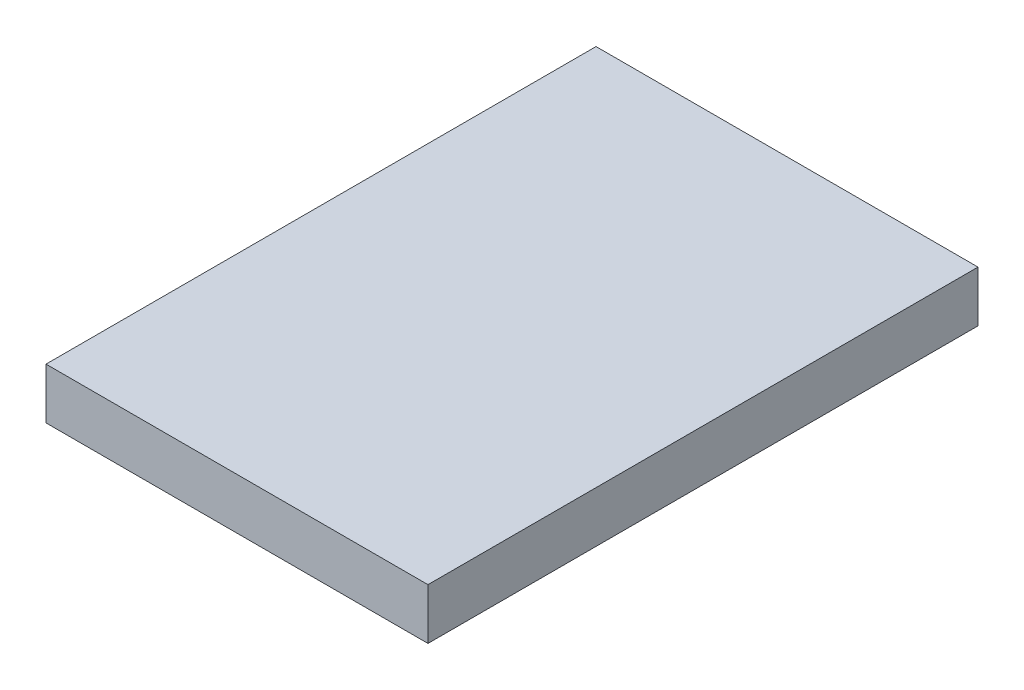
ISO-10303-21;
HEADER;
FILE_DESCRIPTION(('STEP AP214'),'2;1');
FILE_NAME('part.step','',(''),(''),'','','');
FILE_SCHEMA(('AUTOMOTIVE_DESIGN { 1 0 10303 214 1 1 1 1 }'));
ENDSEC;
DATA;
#1=APPLICATION_CONTEXT('core data for automotive mechanical design processes');
#2=APPLICATION_PROTOCOL_DEFINITION('international standard','automotive_design',2000,#1);
#3=PRODUCT_CONTEXT('',#1,'mechanical');
#4=PRODUCT('Part','Part','',(#3));
#5=PRODUCT_RELATED_PRODUCT_CATEGORY('part','',(#4));
#6=PRODUCT_DEFINITION_FORMATION('','',#4);
#7=PRODUCT_DEFINITION_CONTEXT('part definition',#1,'design');
#8=PRODUCT_DEFINITION('design','',#6,#7);
#9=PRODUCT_DEFINITION_SHAPE('','',#8);
#10=(LENGTH_UNIT() NAMED_UNIT(*) SI_UNIT(.MILLI.,.METRE.));
#11=(NAMED_UNIT(*) PLANE_ANGLE_UNIT() SI_UNIT($,.RADIAN.));
#12=(NAMED_UNIT(*) SI_UNIT($,.STERADIAN.) SOLID_ANGLE_UNIT());
#13=UNCERTAINTY_MEASURE_WITH_UNIT(LENGTH_MEASURE(1.E-05),#10,'distance_accuracy_value','');
#14=(GEOMETRIC_REPRESENTATION_CONTEXT(3) GLOBAL_UNCERTAINTY_ASSIGNED_CONTEXT((#13)) GLOBAL_UNIT_ASSIGNED_CONTEXT((#10,
#11,#12)) REPRESENTATION_CONTEXT('',''));
#15=CARTESIAN_POINT('',(0.,0.,0.));
#16=DIRECTION('',(0.,0.,1.));
#17=DIRECTION('',(1.,0.,0.));
#18=AXIS2_PLACEMENT_3D('',#15,#16,#17);
#19=CARTESIAN_POINT('',(3.75,1.,-5.4));
#20=DIRECTION('',(-1.,0.,0.));
#21=DIRECTION('',(0.,0.,1.));
#22=AXIS2_PLACEMENT_3D('',#19,#20,#21);
#23=PLANE('',#22);
#24=DIRECTION('',(0.,0.,-1.));
#25=VECTOR('',#24,1.);
#26=CARTESIAN_POINT('',(3.75,0.,-5.4));
#27=LINE('',#26,#25);
#28=CARTESIAN_POINT('',(3.75,0.,5.4));
#29=VERTEX_POINT('',#28);
#30=CARTESIAN_POINT('',(3.75,0.,-5.4));
#31=VERTEX_POINT('',#30);
#32=EDGE_CURVE('E95',#29,#31,#27,.T.);
#33=ORIENTED_EDGE('',*,*,#32,.T.);
#34=DIRECTION('',(0.,-1.,0.));
#35=VECTOR('',#34,1.);
#36=CARTESIAN_POINT('',(3.75,1.,-5.4));
#37=LINE('',#36,#35);
#38=CARTESIAN_POINT('',(3.75,1.,-5.4));
#39=VERTEX_POINT('',#38);
#40=EDGE_CURVE('E11',#39,#31,#37,.T.);
#41=ORIENTED_EDGE('',*,*,#40,.F.);
#42=DIRECTION('',(0.,0.,-1.));
#43=VECTOR('',#42,1.);
#44=CARTESIAN_POINT('',(3.75,1.,-5.4));
#45=LINE('',#44,#43);
#46=CARTESIAN_POINT('',(3.75,1.,5.4));
#47=VERTEX_POINT('',#46);
#48=EDGE_CURVE('E83',#47,#39,#45,.T.);
#49=ORIENTED_EDGE('',*,*,#48,.F.);
#50=DIRECTION('',(0.,-1.,0.));
#51=VECTOR('',#50,1.);
#52=CARTESIAN_POINT('',(3.75,1.,5.4));
#53=LINE('',#52,#51);
#54=EDGE_CURVE('E91',#47,#29,#53,.T.);
#55=ORIENTED_EDGE('',*,*,#54,.T.);
#56=EDGE_LOOP('',(#33,#41,#49,#55));
#57=FACE_BOUND('',#56,.T.);
#58=ADVANCED_FACE('F32',(#57),#23,.F.);
#59=CARTESIAN_POINT('',(-3.75,1.,-5.4));
#60=DIRECTION('',(0.,0.,1.));
#61=DIRECTION('',(1.,0.,0.));
#62=AXIS2_PLACEMENT_3D('',#59,#60,#61);
#63=PLANE('',#62);
#64=DIRECTION('',(-1.,0.,0.));
#65=VECTOR('',#64,1.);
#66=CARTESIAN_POINT('',(-3.75,0.,-5.4));
#67=LINE('',#66,#65);
#68=CARTESIAN_POINT('',(-3.75,0.,-5.4));
#69=VERTEX_POINT('',#68);
#70=EDGE_CURVE('E87',#31,#69,#67,.T.);
#71=ORIENTED_EDGE('',*,*,#70,.T.);
#72=DIRECTION('',(0.,-1.,0.));
#73=VECTOR('',#72,1.);
#74=CARTESIAN_POINT('',(-3.75,1.,-5.4));
#75=LINE('',#74,#73);
#76=CARTESIAN_POINT('',(-3.75,1.,-5.4));
#77=VERTEX_POINT('',#76);
#78=EDGE_CURVE('E40',#77,#69,#75,.T.);
#79=ORIENTED_EDGE('',*,*,#78,.F.);
#80=DIRECTION('',(-1.,0.,0.));
#81=VECTOR('',#80,1.);
#82=CARTESIAN_POINT('',(-3.75,1.,-5.4));
#83=LINE('',#82,#81);
#84=EDGE_CURVE('E78',#39,#77,#83,.T.);
#85=ORIENTED_EDGE('',*,*,#84,.F.);
#86=ORIENTED_EDGE('',*,*,#40,.T.);
#87=EDGE_LOOP('',(#71,#79,#85,#86));
#88=FACE_BOUND('',#87,.T.);
#89=ADVANCED_FACE('F86',(#88),#63,.F.);
#90=CARTESIAN_POINT('',(-3.75,1.,-5.4));
#91=DIRECTION('',(1.,0.,0.));
#92=DIRECTION('',(0.,0.,-1.));
#93=AXIS2_PLACEMENT_3D('',#90,#91,#92);
#94=PLANE('',#93);
#95=DIRECTION('',(0.,0.,1.));
#96=VECTOR('',#95,1.);
#97=CARTESIAN_POINT('',(-3.75,0.,-5.4));
#98=LINE('',#97,#96);
#99=CARTESIAN_POINT('',(-3.75,0.,5.4));
#100=VERTEX_POINT('',#99);
#101=EDGE_CURVE('E65',#69,#100,#98,.T.);
#102=ORIENTED_EDGE('',*,*,#101,.T.);
#103=DIRECTION('',(0.,-1.,0.));
#104=VECTOR('',#103,1.);
#105=CARTESIAN_POINT('',(-3.75,1.,5.4));
#106=LINE('',#105,#104);
#107=CARTESIAN_POINT('',(-3.75,1.,5.4));
#108=VERTEX_POINT('',#107);
#109=EDGE_CURVE('E88',#108,#100,#106,.T.);
#110=ORIENTED_EDGE('',*,*,#109,.F.);
#111=DIRECTION('',(0.,0.,1.));
#112=VECTOR('',#111,1.);
#113=CARTESIAN_POINT('',(-3.75,1.,-5.4));
#114=LINE('',#113,#112);
#115=EDGE_CURVE('E81',#77,#108,#114,.T.);
#116=ORIENTED_EDGE('',*,*,#115,.F.);
#117=ORIENTED_EDGE('',*,*,#78,.T.);
#118=EDGE_LOOP('',(#102,#110,#116,#117));
#119=FACE_BOUND('',#118,.T.);
#120=ADVANCED_FACE('F89',(#119),#94,.F.);
#121=CARTESIAN_POINT('',(-3.75,1.,5.4));
#122=DIRECTION('',(0.,0.,-1.));
#123=DIRECTION('',(-1.,0.,0.));
#124=AXIS2_PLACEMENT_3D('',#121,#122,#123);
#125=PLANE('',#124);
#126=DIRECTION('',(1.,0.,0.));
#127=VECTOR('',#126,1.);
#128=CARTESIAN_POINT('',(-3.75,0.,5.4));
#129=LINE('',#128,#127);
#130=EDGE_CURVE('E71',#100,#29,#129,.T.);
#131=ORIENTED_EDGE('',*,*,#130,.T.);
#132=ORIENTED_EDGE('',*,*,#54,.F.);
#133=DIRECTION('',(1.,0.,0.));
#134=VECTOR('',#133,1.);
#135=CARTESIAN_POINT('',(-3.75,1.,5.4));
#136=LINE('',#135,#134);
#137=EDGE_CURVE('E48',#108,#47,#136,.T.);
#138=ORIENTED_EDGE('',*,*,#137,.F.);
#139=ORIENTED_EDGE('',*,*,#109,.T.);
#140=EDGE_LOOP('',(#131,#132,#138,#139));
#141=FACE_BOUND('',#140,.T.);
#142=ADVANCED_FACE('F102',(#141),#125,.F.);
#143=CARTESIAN_POINT('',(0.,1.,0.));
#144=DIRECTION('',(0.,1.,0.));
#145=DIRECTION('',(0.,0.,1.));
#146=AXIS2_PLACEMENT_3D('',#143,#144,#145);
#147=PLANE('',#146);
#148=ORIENTED_EDGE('',*,*,#48,.T.);
#149=ORIENTED_EDGE('',*,*,#84,.T.);
#150=ORIENTED_EDGE('',*,*,#115,.T.);
#151=ORIENTED_EDGE('',*,*,#137,.T.);
#152=EDGE_LOOP('',(#148,#149,#150,#151));
#153=FACE_BOUND('',#152,.T.);
#154=ADVANCED_FACE('F79',(#153),#147,.T.);
#155=CARTESIAN_POINT('',(0.,0.,0.));
#156=DIRECTION('',(0.,1.,0.));
#157=DIRECTION('',(0.,0.,1.));
#158=AXIS2_PLACEMENT_3D('',#155,#156,#157);
#159=PLANE('',#158);
#160=ORIENTED_EDGE('',*,*,#32,.F.);
#161=ORIENTED_EDGE('',*,*,#130,.F.);
#162=ORIENTED_EDGE('',*,*,#101,.F.);
#163=ORIENTED_EDGE('',*,*,#70,.F.);
#164=EDGE_LOOP('',(#160,#161,#162,#163));
#165=FACE_BOUND('',#164,.T.);
#166=ADVANCED_FACE('F105',(#165),#159,.F.);
#167=CLOSED_SHELL('',(#58,#89,#120,#142,#154,#166));
#168=MANIFOLD_SOLID_BREP('B2',#167);
#169=ADVANCED_BREP_SHAPE_REPRESENTATION('',(#18,#168),#14);
#170=SHAPE_DEFINITION_REPRESENTATION(#9,#169);
ENDSEC;
END-ISO-10303-21;
